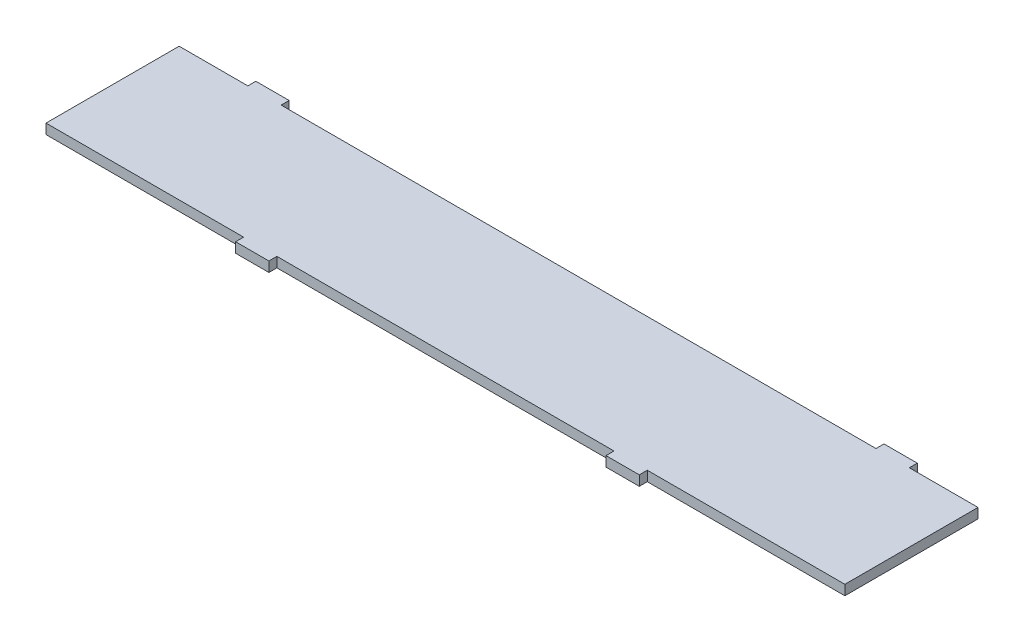
ISO-10303-21;
HEADER;
FILE_DESCRIPTION(('STEP AP214'),'2;1');
FILE_NAME('part.step','',(''),(''),'','','');
FILE_SCHEMA(('AUTOMOTIVE_DESIGN { 1 0 10303 214 1 1 1 1 }'));
ENDSEC;
DATA;
#1=APPLICATION_CONTEXT('core data for automotive mechanical design processes');
#2=APPLICATION_PROTOCOL_DEFINITION('international standard','automotive_design',2000,#1);
#3=PRODUCT_CONTEXT('',#1,'mechanical');
#4=PRODUCT('Part','Part','',(#3));
#5=PRODUCT_RELATED_PRODUCT_CATEGORY('part','',(#4));
#6=PRODUCT_DEFINITION_FORMATION('','',#4);
#7=PRODUCT_DEFINITION_CONTEXT('part definition',#1,'design');
#8=PRODUCT_DEFINITION('design','',#6,#7);
#9=PRODUCT_DEFINITION_SHAPE('','',#8);
#10=(LENGTH_UNIT() NAMED_UNIT(*) SI_UNIT(.MILLI.,.METRE.));
#11=(NAMED_UNIT(*) PLANE_ANGLE_UNIT() SI_UNIT($,.RADIAN.));
#12=(NAMED_UNIT(*) SI_UNIT($,.STERADIAN.) SOLID_ANGLE_UNIT());
#13=UNCERTAINTY_MEASURE_WITH_UNIT(LENGTH_MEASURE(1.E-05),#10,'distance_accuracy_value','');
#14=(GEOMETRIC_REPRESENTATION_CONTEXT(3) GLOBAL_UNCERTAINTY_ASSIGNED_CONTEXT((#13)) GLOBAL_UNIT_ASSIGNED_CONTEXT((#10,
#11,#12)) REPRESENTATION_CONTEXT('',''));
#15=CARTESIAN_POINT('',(0.,0.,0.));
#16=DIRECTION('',(0.,0.,1.));
#17=DIRECTION('',(1.,0.,0.));
#18=AXIS2_PLACEMENT_3D('',#15,#16,#17);
#19=CARTESIAN_POINT('',(-600.,15.,100.));
#20=DIRECTION('',(0.,0.,-1.));
#21=DIRECTION('',(-1.,0.,0.));
#22=AXIS2_PLACEMENT_3D('',#19,#20,#21);
#23=PLANE('',#22);
#24=DIRECTION('',(0.,-1.,0.));
#25=VECTOR('',#24,1.);
#26=CARTESIAN_POINT('',(253.2,15.,100.));
#27=LINE('',#26,#25);
#28=CARTESIAN_POINT('',(253.2,15.,100.));
#29=VERTEX_POINT('',#28);
#30=CARTESIAN_POINT('',(253.2,0.,100.));
#31=VERTEX_POINT('',#30);
#32=EDGE_CURVE('E66',#29,#31,#27,.T.);
#33=ORIENTED_EDGE('',*,*,#32,.F.);
#34=DIRECTION('',(1.,0.,0.));
#35=VECTOR('',#34,1.);
#36=CARTESIAN_POINT('',(-600.,15.,100.));
#37=LINE('',#36,#35);
#38=CARTESIAN_POINT('',(-253.2,15.,100.));
#39=VERTEX_POINT('',#38);
#40=EDGE_CURVE('E188',#39,#29,#37,.T.);
#41=ORIENTED_EDGE('',*,*,#40,.F.);
#42=DIRECTION('',(0.,-1.,0.));
#43=VECTOR('',#42,1.);
#44=CARTESIAN_POINT('',(-253.2,15.,100.));
#45=LINE('',#44,#43);
#46=CARTESIAN_POINT('',(-253.2,0.,100.));
#47=VERTEX_POINT('',#46);
#48=EDGE_CURVE('E267',#39,#47,#45,.T.);
#49=ORIENTED_EDGE('',*,*,#48,.T.);
#50=DIRECTION('',(1.,0.,0.));
#51=VECTOR('',#50,1.);
#52=CARTESIAN_POINT('',(-600.,0.,100.));
#53=LINE('',#52,#51);
#54=EDGE_CURVE('E374',#47,#31,#53,.T.);
#55=ORIENTED_EDGE('',*,*,#54,.T.);
#56=EDGE_LOOP('',(#33,#41,#49,#55));
#57=FACE_BOUND('',#56,.T.);
#58=ADVANCED_FACE('F42',(#57),#23,.F.);
#59=DIRECTION('',(0.,-1.,0.));
#60=VECTOR('',#59,1.);
#61=CARTESIAN_POINT('',(303.2,15.,100.));
#62=LINE('',#61,#60);
#63=CARTESIAN_POINT('',(303.2,15.,100.));
#64=VERTEX_POINT('',#63);
#65=CARTESIAN_POINT('',(303.2,0.,100.));
#66=VERTEX_POINT('',#65);
#67=EDGE_CURVE('E210',#64,#66,#62,.T.);
#68=ORIENTED_EDGE('',*,*,#67,.T.);
#69=CARTESIAN_POINT('',(600.,0.,100.));
#70=VERTEX_POINT('',#69);
#71=EDGE_CURVE('E368',#66,#70,#53,.T.);
#72=ORIENTED_EDGE('',*,*,#71,.T.);
#73=DIRECTION('',(0.,-1.,0.));
#74=VECTOR('',#73,1.);
#75=CARTESIAN_POINT('',(600.,15.,100.));
#76=LINE('',#75,#74);
#77=CARTESIAN_POINT('',(600.,15.,100.));
#78=VERTEX_POINT('',#77);
#79=EDGE_CURVE('E228',#78,#70,#76,.T.);
#80=ORIENTED_EDGE('',*,*,#79,.F.);
#81=EDGE_CURVE('E58',#64,#78,#37,.T.);
#82=ORIENTED_EDGE('',*,*,#81,.F.);
#83=EDGE_LOOP('',(#68,#72,#80,#82));
#84=FACE_BOUND('',#83,.T.);
#85=ADVANCED_FACE('F403',(#84),#23,.F.);
#86=DIRECTION('',(0.,-1.,0.));
#87=VECTOR('',#86,1.);
#88=CARTESIAN_POINT('',(-303.2,15.,100.));
#89=LINE('',#88,#87);
#90=CARTESIAN_POINT('',(-303.2,15.,100.));
#91=VERTEX_POINT('',#90);
#92=CARTESIAN_POINT('',(-303.2,0.,100.));
#93=VERTEX_POINT('',#92);
#94=EDGE_CURVE('E255',#91,#93,#89,.T.);
#95=ORIENTED_EDGE('',*,*,#94,.F.);
#96=CARTESIAN_POINT('',(-600.,15.,100.));
#97=VERTEX_POINT('',#96);
#98=EDGE_CURVE('E222',#97,#91,#37,.T.);
#99=ORIENTED_EDGE('',*,*,#98,.F.);
#100=DIRECTION('',(0.,-1.,0.));
#101=VECTOR('',#100,1.);
#102=CARTESIAN_POINT('',(-600.,15.,100.));
#103=LINE('',#102,#101);
#104=CARTESIAN_POINT('',(-600.,0.,100.));
#105=VERTEX_POINT('',#104);
#106=EDGE_CURVE('E382',#97,#105,#103,.T.);
#107=ORIENTED_EDGE('',*,*,#106,.T.);
#108=EDGE_CURVE('E376',#105,#93,#53,.T.);
#109=ORIENTED_EDGE('',*,*,#108,.T.);
#110=EDGE_LOOP('',(#95,#99,#107,#109));
#111=FACE_BOUND('',#110,.T.);
#112=ADVANCED_FACE('F395',(#111),#23,.F.);
#113=CARTESIAN_POINT('',(-600.,15.,-100.));
#114=DIRECTION('',(0.,0.,1.));
#115=DIRECTION('',(1.,0.,0.));
#116=AXIS2_PLACEMENT_3D('',#113,#114,#115);
#117=PLANE('',#116);
#118=DIRECTION('',(0.,-1.,0.));
#119=VECTOR('',#118,1.);
#120=CARTESIAN_POINT('',(446.8,15.,-100.));
#121=LINE('',#120,#119);
#122=CARTESIAN_POINT('',(446.8,15.,-100.));
#123=VERTEX_POINT('',#122);
#124=CARTESIAN_POINT('',(446.8,0.,-100.));
#125=VERTEX_POINT('',#124);
#126=EDGE_CURVE('E325',#123,#125,#121,.T.);
#127=ORIENTED_EDGE('',*,*,#126,.T.);
#128=DIRECTION('',(-1.,0.,0.));
#129=VECTOR('',#128,1.);
#130=CARTESIAN_POINT('',(-600.,0.,-100.));
#131=LINE('',#130,#129);
#132=CARTESIAN_POINT('',(-446.8,0.,-100.));
#133=VERTEX_POINT('',#132);
#134=EDGE_CURVE('E355',#125,#133,#131,.T.);
#135=ORIENTED_EDGE('',*,*,#134,.T.);
#136=DIRECTION('',(0.,-1.,0.));
#137=VECTOR('',#136,1.);
#138=CARTESIAN_POINT('',(-446.8,15.,-100.));
#139=LINE('',#138,#137);
#140=CARTESIAN_POINT('',(-446.8,15.,-100.));
#141=VERTEX_POINT('',#140);
#142=EDGE_CURVE('E317',#141,#133,#139,.T.);
#143=ORIENTED_EDGE('',*,*,#142,.F.);
#144=DIRECTION('',(-1.,0.,0.));
#145=VECTOR('',#144,1.);
#146=CARTESIAN_POINT('',(-600.,15.,-100.));
#147=LINE('',#146,#145);
#148=EDGE_CURVE('E301',#123,#141,#147,.T.);
#149=ORIENTED_EDGE('',*,*,#148,.F.);
#150=EDGE_LOOP('',(#127,#135,#143,#149));
#151=FACE_BOUND('',#150,.T.);
#152=ADVANCED_FACE('F418',(#151),#117,.F.);
#153=DIRECTION('',(0.,-1.,0.));
#154=VECTOR('',#153,1.);
#155=CARTESIAN_POINT('',(496.8,15.,-100.));
#156=LINE('',#155,#154);
#157=CARTESIAN_POINT('',(496.8,15.,-100.));
#158=VERTEX_POINT('',#157);
#159=CARTESIAN_POINT('',(496.8,0.,-100.));
#160=VERTEX_POINT('',#159);
#161=EDGE_CURVE('E431',#158,#160,#156,.T.);
#162=ORIENTED_EDGE('',*,*,#161,.F.);
#163=CARTESIAN_POINT('',(600.,15.,-100.));
#164=VERTEX_POINT('',#163);
#165=EDGE_CURVE('E296',#164,#158,#147,.T.);
#166=ORIENTED_EDGE('',*,*,#165,.F.);
#167=DIRECTION('',(0.,-1.,0.));
#168=VECTOR('',#167,1.);
#169=CARTESIAN_POINT('',(600.,15.,-100.));
#170=LINE('',#169,#168);
#171=CARTESIAN_POINT('',(600.,0.,-100.));
#172=VERTEX_POINT('',#171);
#173=EDGE_CURVE('E12',#164,#172,#170,.T.);
#174=ORIENTED_EDGE('',*,*,#173,.T.);
#175=EDGE_CURVE('E356',#172,#160,#131,.T.);
#176=ORIENTED_EDGE('',*,*,#175,.T.);
#177=EDGE_LOOP('',(#162,#166,#174,#176));
#178=FACE_BOUND('',#177,.T.);
#179=ADVANCED_FACE('F468',(#178),#117,.F.);
#180=CARTESIAN_POINT('',(600.,15.,100.));
#181=DIRECTION('',(-1.,0.,0.));
#182=DIRECTION('',(0.,0.,1.));
#183=AXIS2_PLACEMENT_3D('',#180,#181,#182);
#184=PLANE('',#183);
#185=DIRECTION('',(0.,0.,-1.));
#186=VECTOR('',#185,1.);
#187=CARTESIAN_POINT('',(600.,0.,100.));
#188=LINE('',#187,#186);
#189=EDGE_CURVE('E232',#70,#172,#188,.T.);
#190=ORIENTED_EDGE('',*,*,#189,.T.);
#191=ORIENTED_EDGE('',*,*,#173,.F.);
#192=DIRECTION('',(0.,0.,-1.));
#193=VECTOR('',#192,1.);
#194=CARTESIAN_POINT('',(600.,15.,100.));
#195=LINE('',#194,#193);
#196=EDGE_CURVE('E303',#78,#164,#195,.T.);
#197=ORIENTED_EDGE('',*,*,#196,.F.);
#198=ORIENTED_EDGE('',*,*,#79,.T.);
#199=EDGE_LOOP('',(#190,#191,#197,#198));
#200=FACE_BOUND('',#199,.T.);
#201=ADVANCED_FACE('F44',(#200),#184,.F.);
#202=CARTESIAN_POINT('',(-496.8,15.,-100.));
#203=VERTEX_POINT('',#202);
#204=CARTESIAN_POINT('',(-600.,15.,-100.));
#205=VERTEX_POINT('',#204);
#206=EDGE_CURVE('E302',#203,#205,#147,.T.);
#207=ORIENTED_EDGE('',*,*,#206,.F.);
#208=DIRECTION('',(0.,-1.,0.));
#209=VECTOR('',#208,1.);
#210=CARTESIAN_POINT('',(-496.8,15.,-100.));
#211=LINE('',#210,#209);
#212=CARTESIAN_POINT('',(-496.8,0.,-100.));
#213=VERTEX_POINT('',#212);
#214=EDGE_CURVE('E335',#203,#213,#211,.T.);
#215=ORIENTED_EDGE('',*,*,#214,.T.);
#216=CARTESIAN_POINT('',(-600.,0.,-100.));
#217=VERTEX_POINT('',#216);
#218=EDGE_CURVE('E349',#213,#217,#131,.T.);
#219=ORIENTED_EDGE('',*,*,#218,.T.);
#220=DIRECTION('',(0.,-1.,0.));
#221=VECTOR('',#220,1.);
#222=CARTESIAN_POINT('',(-600.,15.,-100.));
#223=LINE('',#222,#221);
#224=EDGE_CURVE('E51',#205,#217,#223,.T.);
#225=ORIENTED_EDGE('',*,*,#224,.F.);
#226=EDGE_LOOP('',(#207,#215,#219,#225));
#227=FACE_BOUND('',#226,.T.);
#228=ADVANCED_FACE('F498',(#227),#117,.F.);
#229=CARTESIAN_POINT('',(-600.,15.,100.));
#230=DIRECTION('',(1.,0.,0.));
#231=DIRECTION('',(0.,0.,-1.));
#232=AXIS2_PLACEMENT_3D('',#229,#230,#231);
#233=PLANE('',#232);
#234=DIRECTION('',(0.,0.,1.));
#235=VECTOR('',#234,1.);
#236=CARTESIAN_POINT('',(-600.,0.,100.));
#237=LINE('',#236,#235);
#238=EDGE_CURVE('E364',#217,#105,#237,.T.);
#239=ORIENTED_EDGE('',*,*,#238,.T.);
#240=ORIENTED_EDGE('',*,*,#106,.F.);
#241=DIRECTION('',(0.,0.,1.));
#242=VECTOR('',#241,1.);
#243=CARTESIAN_POINT('',(-600.,15.,100.));
#244=LINE('',#243,#242);
#245=EDGE_CURVE('E229',#205,#97,#244,.T.);
#246=ORIENTED_EDGE('',*,*,#245,.F.);
#247=ORIENTED_EDGE('',*,*,#224,.T.);
#248=EDGE_LOOP('',(#239,#240,#246,#247));
#249=FACE_BOUND('',#248,.T.);
#250=ADVANCED_FACE('F386',(#249),#233,.F.);
#251=CARTESIAN_POINT('',(0.,15.,0.));
#252=DIRECTION('',(0.,-1.,0.));
#253=DIRECTION('',(0.,0.,-1.));
#254=AXIS2_PLACEMENT_3D('',#251,#252,#253);
#255=PLANE('',#254);
#256=ORIENTED_EDGE('',*,*,#196,.T.);
#257=ORIENTED_EDGE('',*,*,#165,.T.);
#258=DIRECTION('',(0.,0.,-1.));
#259=VECTOR('',#258,1.);
#260=CARTESIAN_POINT('',(496.8,15.,-100.));
#261=LINE('',#260,#259);
#262=CARTESIAN_POINT('',(496.8,15.,-112.));
#263=VERTEX_POINT('',#262);
#264=EDGE_CURVE('E285',#158,#263,#261,.T.);
#265=ORIENTED_EDGE('',*,*,#264,.T.);
#266=DIRECTION('',(-1.,0.,0.));
#267=VECTOR('',#266,1.);
#268=CARTESIAN_POINT('',(446.8,15.,-112.));
#269=LINE('',#268,#267);
#270=CARTESIAN_POINT('',(446.8,15.,-112.));
#271=VERTEX_POINT('',#270);
#272=EDGE_CURVE('E442',#263,#271,#269,.T.);
#273=ORIENTED_EDGE('',*,*,#272,.T.);
#274=DIRECTION('',(0.,0.,1.));
#275=VECTOR('',#274,1.);
#276=CARTESIAN_POINT('',(446.8,15.,-100.));
#277=LINE('',#276,#275);
#278=EDGE_CURVE('E280',#271,#123,#277,.T.);
#279=ORIENTED_EDGE('',*,*,#278,.T.);
#280=ORIENTED_EDGE('',*,*,#148,.T.);
#281=DIRECTION('',(0.,0.,-1.));
#282=VECTOR('',#281,1.);
#283=CARTESIAN_POINT('',(-446.8,15.,-100.));
#284=LINE('',#283,#282);
#285=CARTESIAN_POINT('',(-446.8,15.,-112.));
#286=VERTEX_POINT('',#285);
#287=EDGE_CURVE('E331',#141,#286,#284,.T.);
#288=ORIENTED_EDGE('',*,*,#287,.T.);
#289=DIRECTION('',(-1.,0.,0.));
#290=VECTOR('',#289,1.);
#291=CARTESIAN_POINT('',(-446.8,15.,-112.));
#292=LINE('',#291,#290);
#293=CARTESIAN_POINT('',(-496.8,15.,-112.));
#294=VERTEX_POINT('',#293);
#295=EDGE_CURVE('E318',#286,#294,#292,.T.);
#296=ORIENTED_EDGE('',*,*,#295,.T.);
#297=DIRECTION('',(0.,0.,1.));
#298=VECTOR('',#297,1.);
#299=CARTESIAN_POINT('',(-496.8,15.,-100.));
#300=LINE('',#299,#298);
#301=EDGE_CURVE('E313',#294,#203,#300,.T.);
#302=ORIENTED_EDGE('',*,*,#301,.T.);
#303=ORIENTED_EDGE('',*,*,#206,.T.);
#304=ORIENTED_EDGE('',*,*,#245,.T.);
#305=ORIENTED_EDGE('',*,*,#98,.T.);
#306=DIRECTION('',(0.,0.,1.));
#307=VECTOR('',#306,1.);
#308=CARTESIAN_POINT('',(-303.2,15.,100.));
#309=LINE('',#308,#307);
#310=CARTESIAN_POINT('',(-303.2,15.,112.));
#311=VERTEX_POINT('',#310);
#312=EDGE_CURVE('E242',#91,#311,#309,.T.);
#313=ORIENTED_EDGE('',*,*,#312,.T.);
#314=DIRECTION('',(1.,0.,0.));
#315=VECTOR('',#314,1.);
#316=CARTESIAN_POINT('',(-303.2,15.,112.));
#317=LINE('',#316,#315);
#318=CARTESIAN_POINT('',(-253.2,15.,112.));
#319=VERTEX_POINT('',#318);
#320=EDGE_CURVE('E247',#311,#319,#317,.T.);
#321=ORIENTED_EDGE('',*,*,#320,.T.);
#322=DIRECTION('',(0.,0.,-1.));
#323=VECTOR('',#322,1.);
#324=CARTESIAN_POINT('',(-253.2,15.,100.));
#325=LINE('',#324,#323);
#326=EDGE_CURVE('E251',#319,#39,#325,.T.);
#327=ORIENTED_EDGE('',*,*,#326,.T.);
#328=ORIENTED_EDGE('',*,*,#40,.T.);
#329=DIRECTION('',(0.,0.,1.));
#330=VECTOR('',#329,1.);
#331=CARTESIAN_POINT('',(253.2,15.,100.));
#332=LINE('',#331,#330);
#333=CARTESIAN_POINT('',(253.2,15.,112.));
#334=VERTEX_POINT('',#333);
#335=EDGE_CURVE('E181',#29,#334,#332,.T.);
#336=ORIENTED_EDGE('',*,*,#335,.T.);
#337=DIRECTION('',(1.,0.,0.));
#338=VECTOR('',#337,1.);
#339=CARTESIAN_POINT('',(303.2,15.,112.));
#340=LINE('',#339,#338);
#341=CARTESIAN_POINT('',(303.2,15.,112.));
#342=VERTEX_POINT('',#341);
#343=EDGE_CURVE('E186',#334,#342,#340,.T.);
#344=ORIENTED_EDGE('',*,*,#343,.T.);
#345=DIRECTION('',(0.,0.,-1.));
#346=VECTOR('',#345,1.);
#347=CARTESIAN_POINT('',(303.2,15.,100.));
#348=LINE('',#347,#346);
#349=EDGE_CURVE('E207',#342,#64,#348,.T.);
#350=ORIENTED_EDGE('',*,*,#349,.T.);
#351=ORIENTED_EDGE('',*,*,#81,.T.);
#352=EDGE_LOOP('',(#256,#257,#265,#273,#279,#280,#288,#296,#302,#303,#304,#305,#313,#321,#327,
#328,#336,#344,#350,#351));
#353=FACE_BOUND('',#352,.T.);
#354=ADVANCED_FACE('F184',(#353),#255,.F.);
#355=CARTESIAN_POINT('',(0.,0.,0.));
#356=DIRECTION('',(0.,-1.,0.));
#357=DIRECTION('',(0.,0.,-1.));
#358=AXIS2_PLACEMENT_3D('',#355,#356,#357);
#359=PLANE('',#358);
#360=ORIENTED_EDGE('',*,*,#189,.F.);
#361=ORIENTED_EDGE('',*,*,#71,.F.);
#362=DIRECTION('',(0.,0.,-1.));
#363=VECTOR('',#362,1.);
#364=CARTESIAN_POINT('',(303.2,0.,100.));
#365=LINE('',#364,#363);
#366=CARTESIAN_POINT('',(303.2,0.,112.));
#367=VERTEX_POINT('',#366);
#368=EDGE_CURVE('E191',#367,#66,#365,.T.);
#369=ORIENTED_EDGE('',*,*,#368,.F.);
#370=DIRECTION('',(1.,0.,0.));
#371=VECTOR('',#370,1.);
#372=CARTESIAN_POINT('',(303.2,0.,112.));
#373=LINE('',#372,#371);
#374=CARTESIAN_POINT('',(253.2,0.,112.));
#375=VERTEX_POINT('',#374);
#376=EDGE_CURVE('E461',#375,#367,#373,.T.);
#377=ORIENTED_EDGE('',*,*,#376,.F.);
#378=DIRECTION('',(0.,0.,1.));
#379=VECTOR('',#378,1.);
#380=CARTESIAN_POINT('',(253.2,0.,100.));
#381=LINE('',#380,#379);
#382=EDGE_CURVE('E197',#31,#375,#381,.T.);
#383=ORIENTED_EDGE('',*,*,#382,.F.);
#384=ORIENTED_EDGE('',*,*,#54,.F.);
#385=DIRECTION('',(0.,0.,-1.));
#386=VECTOR('',#385,1.);
#387=CARTESIAN_POINT('',(-253.2,0.,100.));
#388=LINE('',#387,#386);
#389=CARTESIAN_POINT('',(-253.2,0.,112.));
#390=VERTEX_POINT('',#389);
#391=EDGE_CURVE('E248',#390,#47,#388,.T.);
#392=ORIENTED_EDGE('',*,*,#391,.F.);
#393=DIRECTION('',(1.,0.,0.));
#394=VECTOR('',#393,1.);
#395=CARTESIAN_POINT('',(-303.2,0.,112.));
#396=LINE('',#395,#394);
#397=CARTESIAN_POINT('',(-303.2,0.,112.));
#398=VERTEX_POINT('',#397);
#399=EDGE_CURVE('E260',#398,#390,#396,.T.);
#400=ORIENTED_EDGE('',*,*,#399,.F.);
#401=DIRECTION('',(0.,0.,1.));
#402=VECTOR('',#401,1.);
#403=CARTESIAN_POINT('',(-303.2,0.,100.));
#404=LINE('',#403,#402);
#405=EDGE_CURVE('E256',#93,#398,#404,.T.);
#406=ORIENTED_EDGE('',*,*,#405,.F.);
#407=ORIENTED_EDGE('',*,*,#108,.F.);
#408=ORIENTED_EDGE('',*,*,#238,.F.);
#409=ORIENTED_EDGE('',*,*,#218,.F.);
#410=DIRECTION('',(0.,0.,1.));
#411=VECTOR('',#410,1.);
#412=CARTESIAN_POINT('',(-496.8,0.,-100.));
#413=LINE('',#412,#411);
#414=CARTESIAN_POINT('',(-496.8,0.,-112.));
#415=VERTEX_POINT('',#414);
#416=EDGE_CURVE('E328',#415,#213,#413,.T.);
#417=ORIENTED_EDGE('',*,*,#416,.F.);
#418=DIRECTION('',(-1.,0.,0.));
#419=VECTOR('',#418,1.);
#420=CARTESIAN_POINT('',(-446.8,0.,-112.));
#421=LINE('',#420,#419);
#422=CARTESIAN_POINT('',(-446.8,0.,-112.));
#423=VERTEX_POINT('',#422);
#424=EDGE_CURVE('E324',#423,#415,#421,.T.);
#425=ORIENTED_EDGE('',*,*,#424,.F.);
#426=DIRECTION('',(0.,0.,-1.));
#427=VECTOR('',#426,1.);
#428=CARTESIAN_POINT('',(-446.8,0.,-100.));
#429=LINE('',#428,#427);
#430=EDGE_CURVE('E320',#133,#423,#429,.T.);
#431=ORIENTED_EDGE('',*,*,#430,.F.);
#432=ORIENTED_EDGE('',*,*,#134,.F.);
#433=DIRECTION('',(0.,0.,1.));
#434=VECTOR('',#433,1.);
#435=CARTESIAN_POINT('',(446.8,0.,-100.));
#436=LINE('',#435,#434);
#437=CARTESIAN_POINT('',(446.8,0.,-112.));
#438=VERTEX_POINT('',#437);
#439=EDGE_CURVE('E279',#438,#125,#436,.T.);
#440=ORIENTED_EDGE('',*,*,#439,.F.);
#441=DIRECTION('',(-1.,0.,0.));
#442=VECTOR('',#441,1.);
#443=CARTESIAN_POINT('',(446.8,0.,-112.));
#444=LINE('',#443,#442);
#445=CARTESIAN_POINT('',(496.8,0.,-112.));
#446=VERTEX_POINT('',#445);
#447=EDGE_CURVE('E286',#446,#438,#444,.T.);
#448=ORIENTED_EDGE('',*,*,#447,.F.);
#449=DIRECTION('',(0.,0.,-1.));
#450=VECTOR('',#449,1.);
#451=CARTESIAN_POINT('',(496.8,0.,-100.));
#452=LINE('',#451,#450);
#453=EDGE_CURVE('E447',#160,#446,#452,.T.);
#454=ORIENTED_EDGE('',*,*,#453,.F.);
#455=ORIENTED_EDGE('',*,*,#175,.F.);
#456=EDGE_LOOP('',(#360,#361,#369,#377,#383,#384,#392,#400,#406,#407,#408,#409,#417,#425,#431,
#432,#440,#448,#454,#455));
#457=FACE_BOUND('',#456,.T.);
#458=ADVANCED_FACE('F390',(#457),#359,.T.);
#459=CARTESIAN_POINT('',(-446.8,15.,-100.));
#460=DIRECTION('',(-1.,0.,0.));
#461=DIRECTION('',(0.,0.,1.));
#462=AXIS2_PLACEMENT_3D('',#459,#460,#461);
#463=PLANE('',#462);
#464=ORIENTED_EDGE('',*,*,#430,.T.);
#465=DIRECTION('',(0.,-1.,0.));
#466=VECTOR('',#465,1.);
#467=CARTESIAN_POINT('',(-446.8,15.,-112.));
#468=LINE('',#467,#466);
#469=EDGE_CURVE('E342',#286,#423,#468,.T.);
#470=ORIENTED_EDGE('',*,*,#469,.F.);
#471=ORIENTED_EDGE('',*,*,#287,.F.);
#472=ORIENTED_EDGE('',*,*,#142,.T.);
#473=EDGE_LOOP('',(#464,#470,#471,#472));
#474=FACE_BOUND('',#473,.T.);
#475=ADVANCED_FACE('F415',(#474),#463,.F.);
#476=CARTESIAN_POINT('',(-446.8,15.,-112.));
#477=DIRECTION('',(0.,0.,1.));
#478=DIRECTION('',(1.,0.,0.));
#479=AXIS2_PLACEMENT_3D('',#476,#477,#478);
#480=PLANE('',#479);
#481=ORIENTED_EDGE('',*,*,#424,.T.);
#482=DIRECTION('',(0.,-1.,0.));
#483=VECTOR('',#482,1.);
#484=CARTESIAN_POINT('',(-496.8,15.,-112.));
#485=LINE('',#484,#483);
#486=EDGE_CURVE('E339',#294,#415,#485,.T.);
#487=ORIENTED_EDGE('',*,*,#486,.F.);
#488=ORIENTED_EDGE('',*,*,#295,.F.);
#489=ORIENTED_EDGE('',*,*,#469,.T.);
#490=EDGE_LOOP('',(#481,#487,#488,#489));
#491=FACE_BOUND('',#490,.T.);
#492=ADVANCED_FACE('F423',(#491),#480,.F.);
#493=CARTESIAN_POINT('',(-496.8,15.,-100.));
#494=DIRECTION('',(1.,0.,0.));
#495=DIRECTION('',(0.,0.,-1.));
#496=AXIS2_PLACEMENT_3D('',#493,#494,#495);
#497=PLANE('',#496);
#498=ORIENTED_EDGE('',*,*,#416,.T.);
#499=ORIENTED_EDGE('',*,*,#214,.F.);
#500=ORIENTED_EDGE('',*,*,#301,.F.);
#501=ORIENTED_EDGE('',*,*,#486,.T.);
#502=EDGE_LOOP('',(#498,#499,#500,#501));
#503=FACE_BOUND('',#502,.T.);
#504=ADVANCED_FACE('F426',(#503),#497,.F.);
#505=CARTESIAN_POINT('',(446.8,15.,-100.));
#506=DIRECTION('',(1.,0.,0.));
#507=DIRECTION('',(0.,0.,-1.));
#508=AXIS2_PLACEMENT_3D('',#505,#506,#507);
#509=PLANE('',#508);
#510=ORIENTED_EDGE('',*,*,#439,.T.);
#511=ORIENTED_EDGE('',*,*,#126,.F.);
#512=ORIENTED_EDGE('',*,*,#278,.F.);
#513=DIRECTION('',(0.,-1.,0.));
#514=VECTOR('',#513,1.);
#515=CARTESIAN_POINT('',(446.8,15.,-112.));
#516=LINE('',#515,#514);
#517=EDGE_CURVE('E438',#271,#438,#516,.T.);
#518=ORIENTED_EDGE('',*,*,#517,.T.);
#519=EDGE_LOOP('',(#510,#511,#512,#518));
#520=FACE_BOUND('',#519,.T.);
#521=ADVANCED_FACE('F478',(#520),#509,.F.);
#522=CARTESIAN_POINT('',(496.8,15.,-100.));
#523=DIRECTION('',(-1.,0.,0.));
#524=DIRECTION('',(0.,0.,1.));
#525=AXIS2_PLACEMENT_3D('',#522,#523,#524);
#526=PLANE('',#525);
#527=ORIENTED_EDGE('',*,*,#453,.T.);
#528=DIRECTION('',(0.,-1.,0.));
#529=VECTOR('',#528,1.);
#530=CARTESIAN_POINT('',(496.8,15.,-112.));
#531=LINE('',#530,#529);
#532=EDGE_CURVE('E434',#263,#446,#531,.T.);
#533=ORIENTED_EDGE('',*,*,#532,.F.);
#534=ORIENTED_EDGE('',*,*,#264,.F.);
#535=ORIENTED_EDGE('',*,*,#161,.T.);
#536=EDGE_LOOP('',(#527,#533,#534,#535));
#537=FACE_BOUND('',#536,.T.);
#538=ADVANCED_FACE('F472',(#537),#526,.F.);
#539=CARTESIAN_POINT('',(446.8,15.,-112.));
#540=DIRECTION('',(0.,0.,1.));
#541=DIRECTION('',(1.,0.,0.));
#542=AXIS2_PLACEMENT_3D('',#539,#540,#541);
#543=PLANE('',#542);
#544=ORIENTED_EDGE('',*,*,#447,.T.);
#545=ORIENTED_EDGE('',*,*,#517,.F.);
#546=ORIENTED_EDGE('',*,*,#272,.F.);
#547=ORIENTED_EDGE('',*,*,#532,.T.);
#548=EDGE_LOOP('',(#544,#545,#546,#547));
#549=FACE_BOUND('',#548,.T.);
#550=ADVANCED_FACE('F476',(#549),#543,.F.);
#551=CARTESIAN_POINT('',(-303.2,15.,100.));
#552=DIRECTION('',(1.,0.,0.));
#553=DIRECTION('',(0.,0.,-1.));
#554=AXIS2_PLACEMENT_3D('',#551,#552,#553);
#555=PLANE('',#554);
#556=ORIENTED_EDGE('',*,*,#405,.T.);
#557=DIRECTION('',(0.,-1.,0.));
#558=VECTOR('',#557,1.);
#559=CARTESIAN_POINT('',(-303.2,15.,112.));
#560=LINE('',#559,#558);
#561=EDGE_CURVE('E275',#311,#398,#560,.T.);
#562=ORIENTED_EDGE('',*,*,#561,.F.);
#563=ORIENTED_EDGE('',*,*,#312,.F.);
#564=ORIENTED_EDGE('',*,*,#94,.T.);
#565=EDGE_LOOP('',(#556,#562,#563,#564));
#566=FACE_BOUND('',#565,.T.);
#567=ADVANCED_FACE('F581',(#566),#555,.F.);
#568=CARTESIAN_POINT('',(-303.2,15.,112.));
#569=DIRECTION('',(0.,0.,-1.));
#570=DIRECTION('',(-1.,0.,0.));
#571=AXIS2_PLACEMENT_3D('',#568,#569,#570);
#572=PLANE('',#571);
#573=ORIENTED_EDGE('',*,*,#399,.T.);
#574=DIRECTION('',(0.,-1.,0.));
#575=VECTOR('',#574,1.);
#576=CARTESIAN_POINT('',(-253.2,15.,112.));
#577=LINE('',#576,#575);
#578=EDGE_CURVE('E271',#319,#390,#577,.T.);
#579=ORIENTED_EDGE('',*,*,#578,.F.);
#580=ORIENTED_EDGE('',*,*,#320,.F.);
#581=ORIENTED_EDGE('',*,*,#561,.T.);
#582=EDGE_LOOP('',(#573,#579,#580,#581));
#583=FACE_BOUND('',#582,.T.);
#584=ADVANCED_FACE('F590',(#583),#572,.F.);
#585=CARTESIAN_POINT('',(-253.2,15.,100.));
#586=DIRECTION('',(-1.,0.,0.));
#587=DIRECTION('',(0.,0.,1.));
#588=AXIS2_PLACEMENT_3D('',#585,#586,#587);
#589=PLANE('',#588);
#590=ORIENTED_EDGE('',*,*,#391,.T.);
#591=ORIENTED_EDGE('',*,*,#48,.F.);
#592=ORIENTED_EDGE('',*,*,#326,.F.);
#593=ORIENTED_EDGE('',*,*,#578,.T.);
#594=EDGE_LOOP('',(#590,#591,#592,#593));
#595=FACE_BOUND('',#594,.T.);
#596=ADVANCED_FACE('F600',(#595),#589,.F.);
#597=CARTESIAN_POINT('',(253.2,15.,100.));
#598=DIRECTION('',(1.,0.,0.));
#599=DIRECTION('',(0.,0.,-1.));
#600=AXIS2_PLACEMENT_3D('',#597,#598,#599);
#601=PLANE('',#600);
#602=ORIENTED_EDGE('',*,*,#382,.T.);
#603=DIRECTION('',(0.,-1.,0.));
#604=VECTOR('',#603,1.);
#605=CARTESIAN_POINT('',(253.2,15.,112.));
#606=LINE('',#605,#604);
#607=EDGE_CURVE('E194',#334,#375,#606,.T.);
#608=ORIENTED_EDGE('',*,*,#607,.F.);
#609=ORIENTED_EDGE('',*,*,#335,.F.);
#610=ORIENTED_EDGE('',*,*,#32,.T.);
#611=EDGE_LOOP('',(#602,#608,#609,#610));
#612=FACE_BOUND('',#611,.T.);
#613=ADVANCED_FACE('F195',(#612),#601,.F.);
#614=CARTESIAN_POINT('',(303.2,15.,112.));
#615=DIRECTION('',(0.,0.,-1.));
#616=DIRECTION('',(-1.,0.,0.));
#617=AXIS2_PLACEMENT_3D('',#614,#615,#616);
#618=PLANE('',#617);
#619=ORIENTED_EDGE('',*,*,#376,.T.);
#620=DIRECTION('',(0.,-1.,0.));
#621=VECTOR('',#620,1.);
#622=CARTESIAN_POINT('',(303.2,15.,112.));
#623=LINE('',#622,#621);
#624=EDGE_CURVE('E201',#342,#367,#623,.T.);
#625=ORIENTED_EDGE('',*,*,#624,.F.);
#626=ORIENTED_EDGE('',*,*,#343,.F.);
#627=ORIENTED_EDGE('',*,*,#607,.T.);
#628=EDGE_LOOP('',(#619,#625,#626,#627));
#629=FACE_BOUND('',#628,.T.);
#630=ADVANCED_FACE('F203',(#629),#618,.F.);
#631=CARTESIAN_POINT('',(303.2,15.,100.));
#632=DIRECTION('',(-1.,0.,0.));
#633=DIRECTION('',(0.,0.,1.));
#634=AXIS2_PLACEMENT_3D('',#631,#632,#633);
#635=PLANE('',#634);
#636=ORIENTED_EDGE('',*,*,#368,.T.);
#637=ORIENTED_EDGE('',*,*,#67,.F.);
#638=ORIENTED_EDGE('',*,*,#349,.F.);
#639=ORIENTED_EDGE('',*,*,#624,.T.);
#640=EDGE_LOOP('',(#636,#637,#638,#639));
#641=FACE_BOUND('',#640,.T.);
#642=ADVANCED_FACE('F466',(#641),#635,.F.);
#643=CLOSED_SHELL('',(#58,#85,#112,#152,#179,#201,#228,#250,#354,#458,#475,#492,#504,#521,#538,
#550,#567,#584,#596,#613,#630,#642));
#644=MANIFOLD_SOLID_BREP('B2',#643);
#645=ADVANCED_BREP_SHAPE_REPRESENTATION('',(#18,#644),#14);
#646=SHAPE_DEFINITION_REPRESENTATION(#9,#645);
ENDSEC;
END-ISO-10303-21;
